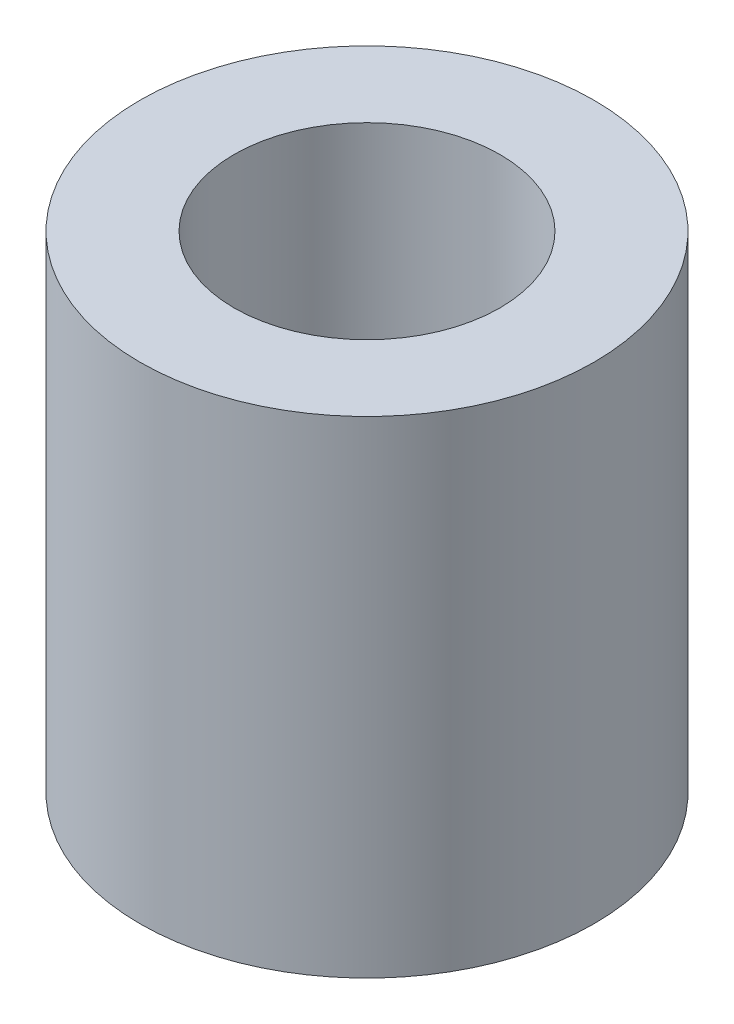
ISO-10303-21;
HEADER;
FILE_DESCRIPTION(('STEP AP214'),'2;1');
FILE_NAME('part.step','',(''),(''),'','','');
FILE_SCHEMA(('AUTOMOTIVE_DESIGN { 1 0 10303 214 1 1 1 1 }'));
ENDSEC;
DATA;
#1=APPLICATION_CONTEXT('core data for automotive mechanical design processes');
#2=APPLICATION_PROTOCOL_DEFINITION('international standard','automotive_design',2000,#1);
#3=PRODUCT_CONTEXT('',#1,'mechanical');
#4=PRODUCT('Part','Part','',(#3));
#5=PRODUCT_RELATED_PRODUCT_CATEGORY('part','',(#4));
#6=PRODUCT_DEFINITION_FORMATION('','',#4);
#7=PRODUCT_DEFINITION_CONTEXT('part definition',#1,'design');
#8=PRODUCT_DEFINITION('design','',#6,#7);
#9=PRODUCT_DEFINITION_SHAPE('','',#8);
#10=(LENGTH_UNIT() NAMED_UNIT(*) SI_UNIT(.MILLI.,.METRE.));
#11=(NAMED_UNIT(*) PLANE_ANGLE_UNIT() SI_UNIT($,.RADIAN.));
#12=(NAMED_UNIT(*) SI_UNIT($,.STERADIAN.) SOLID_ANGLE_UNIT());
#13=UNCERTAINTY_MEASURE_WITH_UNIT(LENGTH_MEASURE(1.E-05),#10,'distance_accuracy_value','');
#14=(GEOMETRIC_REPRESENTATION_CONTEXT(3) GLOBAL_UNCERTAINTY_ASSIGNED_CONTEXT((#13)) GLOBAL_UNIT_ASSIGNED_CONTEXT((#10,
#11,#12)) REPRESENTATION_CONTEXT('',''));
#15=CARTESIAN_POINT('',(0.,0.,0.));
#16=DIRECTION('',(0.,0.,1.));
#17=DIRECTION('',(1.,0.,0.));
#18=AXIS2_PLACEMENT_3D('',#15,#16,#17);
#19=CARTESIAN_POINT('',(0.,0.,0.));
#20=DIRECTION('',(0.,1.,0.));
#21=DIRECTION('',(0.,0.,1.));
#22=AXIS2_PLACEMENT_3D('',#19,#20,#21);
#23=CYLINDRICAL_SURFACE('',#22,4.1);
#24=CARTESIAN_POINT('',(0.,15.,0.));
#25=DIRECTION('',(0.,1.,0.));
#26=DIRECTION('',(0.,0.,1.));
#27=AXIS2_PLACEMENT_3D('',#24,#25,#26);
#28=CIRCLE('',#27,4.1);
#29=CARTESIAN_POINT('',(0.,15.,4.1));
#30=VERTEX_POINT('',#29);
#31=EDGE_CURVE('E46',#30,#30,#28,.T.);
#32=ORIENTED_EDGE('',*,*,#31,.T.);
#33=EDGE_LOOP('',(#32));
#34=FACE_BOUND('',#33,.T.);
#35=CARTESIAN_POINT('',(0.,3.,0.));
#36=DIRECTION('',(0.,-1.,0.));
#37=DIRECTION('',(0.,0.,-1.));
#38=AXIS2_PLACEMENT_3D('',#35,#36,#37);
#39=CIRCLE('',#38,4.1);
#40=CARTESIAN_POINT('',(0.,3.,-4.1));
#41=VERTEX_POINT('',#40);
#42=EDGE_CURVE('E37',#41,#41,#39,.F.);
#43=ORIENTED_EDGE('',*,*,#42,.F.);
#44=EDGE_LOOP('',(#43));
#45=FACE_BOUND('',#44,.T.);
#46=ADVANCED_FACE('F33',(#34,#45),#23,.F.);
#47=CARTESIAN_POINT('',(0.,15.,0.));
#48=DIRECTION('',(0.,-1.,0.));
#49=DIRECTION('',(0.,0.,-1.));
#50=AXIS2_PLACEMENT_3D('',#47,#48,#49);
#51=CYLINDRICAL_SURFACE('',#50,7.);
#52=CARTESIAN_POINT('',(0.,15.,0.));
#53=DIRECTION('',(0.,1.,0.));
#54=DIRECTION('',(0.,0.,1.));
#55=AXIS2_PLACEMENT_3D('',#52,#53,#54);
#56=CIRCLE('',#55,7.);
#57=CARTESIAN_POINT('',(0.,15.,7.));
#58=VERTEX_POINT('',#57);
#59=EDGE_CURVE('E10',#58,#58,#56,.T.);
#60=ORIENTED_EDGE('',*,*,#59,.F.);
#61=EDGE_LOOP('',(#60));
#62=FACE_BOUND('',#61,.T.);
#63=CARTESIAN_POINT('',(0.,0.,0.));
#64=DIRECTION('',(0.,1.,0.));
#65=DIRECTION('',(0.,0.,1.));
#66=AXIS2_PLACEMENT_3D('',#63,#64,#65);
#67=CIRCLE('',#66,7.);
#68=CARTESIAN_POINT('',(0.,0.,7.));
#69=VERTEX_POINT('',#68);
#70=EDGE_CURVE('E41',#69,#69,#67,.T.);
#71=ORIENTED_EDGE('',*,*,#70,.T.);
#72=EDGE_LOOP('',(#71));
#73=FACE_BOUND('',#72,.T.);
#74=ADVANCED_FACE('F35',(#62,#73),#51,.T.);
#75=CARTESIAN_POINT('',(0.,15.,0.));
#76=DIRECTION('',(0.,1.,0.));
#77=DIRECTION('',(0.,0.,1.));
#78=AXIS2_PLACEMENT_3D('',#75,#76,#77);
#79=PLANE('',#78);
#80=ORIENTED_EDGE('',*,*,#31,.F.);
#81=EDGE_LOOP('',(#80));
#82=FACE_BOUND('',#81,.T.);
#83=ORIENTED_EDGE('',*,*,#59,.T.);
#84=EDGE_LOOP('',(#83));
#85=FACE_BOUND('',#84,.T.);
#86=ADVANCED_FACE('F68',(#82,#85),#79,.T.);
#87=CARTESIAN_POINT('',(0.,0.,0.));
#88=DIRECTION('',(0.,1.,0.));
#89=DIRECTION('',(0.,0.,1.));
#90=AXIS2_PLACEMENT_3D('',#87,#88,#89);
#91=PLANE('',#90);
#92=CARTESIAN_POINT('',(0.,0.,0.));
#93=DIRECTION('',(0.,-1.,0.));
#94=DIRECTION('',(0.,0.,-1.));
#95=AXIS2_PLACEMENT_3D('',#92,#93,#94);
#96=CIRCLE('',#95,6.1);
#97=CARTESIAN_POINT('',(0.,0.,-6.1));
#98=VERTEX_POINT('',#97);
#99=EDGE_CURVE('E50',#98,#98,#96,.T.);
#100=ORIENTED_EDGE('',*,*,#99,.F.);
#101=EDGE_LOOP('',(#100));
#102=FACE_BOUND('',#101,.T.);
#103=ORIENTED_EDGE('',*,*,#70,.F.);
#104=EDGE_LOOP('',(#103));
#105=FACE_BOUND('',#104,.T.);
#106=ADVANCED_FACE('F75',(#102,#105),#91,.F.);
#107=CARTESIAN_POINT('',(0.,3.,0.));
#108=DIRECTION('',(0.,-1.,0.));
#109=DIRECTION('',(0.,0.,-1.));
#110=AXIS2_PLACEMENT_3D('',#107,#108,#109);
#111=PLANE('',#110);
#112=CARTESIAN_POINT('',(0.,3.,0.));
#113=DIRECTION('',(0.,-1.,0.));
#114=DIRECTION('',(0.,0.,-1.));
#115=AXIS2_PLACEMENT_3D('',#112,#113,#114);
#116=CIRCLE('',#115,6.1);
#117=CARTESIAN_POINT('',(0.,3.,-6.1));
#118=VERTEX_POINT('',#117);
#119=EDGE_CURVE('E53',#118,#118,#116,.T.);
#120=ORIENTED_EDGE('',*,*,#119,.T.);
#121=EDGE_LOOP('',(#120));
#122=FACE_BOUND('',#121,.T.);
#123=ORIENTED_EDGE('',*,*,#42,.T.);
#124=EDGE_LOOP('',(#123));
#125=FACE_BOUND('',#124,.T.);
#126=ADVANCED_FACE('F60',(#122,#125),#111,.T.);
#127=CARTESIAN_POINT('',(0.,3.,0.));
#128=DIRECTION('',(0.,-1.,0.));
#129=DIRECTION('',(0.,0.,-1.));
#130=AXIS2_PLACEMENT_3D('',#127,#128,#129);
#131=CYLINDRICAL_SURFACE('',#130,6.1);
#132=ORIENTED_EDGE('',*,*,#119,.F.);
#133=EDGE_LOOP('',(#132));
#134=FACE_BOUND('',#133,.T.);
#135=ORIENTED_EDGE('',*,*,#99,.T.);
#136=EDGE_LOOP('',(#135));
#137=FACE_BOUND('',#136,.T.);
#138=ADVANCED_FACE('F72',(#134,#137),#131,.F.);
#139=CLOSED_SHELL('',(#46,#74,#86,#106,#126,#138));
#140=MANIFOLD_SOLID_BREP('B2',#139);
#141=ADVANCED_BREP_SHAPE_REPRESENTATION('',(#18,#140),#14);
#142=SHAPE_DEFINITION_REPRESENTATION(#9,#141);
ENDSEC;
END-ISO-10303-21;
